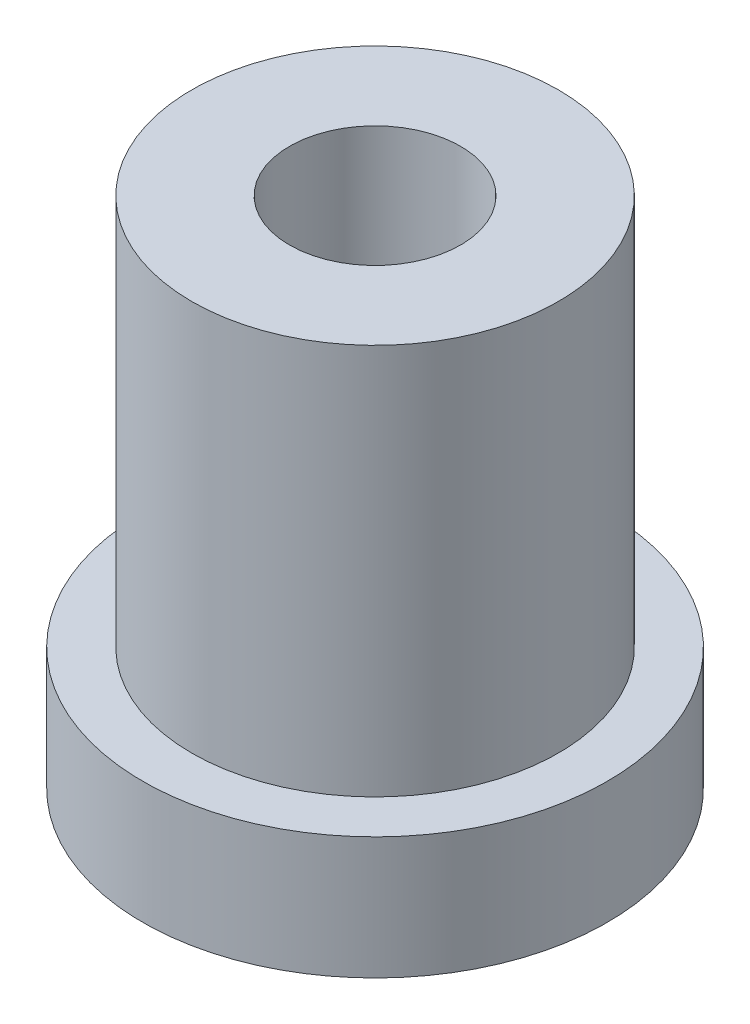
ISO-10303-21;
HEADER;
FILE_DESCRIPTION(('STEP AP214'),'2;1');
FILE_NAME('part.step','',(''),(''),'','','');
FILE_SCHEMA(('AUTOMOTIVE_DESIGN { 1 0 10303 214 1 1 1 1 }'));
ENDSEC;
DATA;
#1=APPLICATION_CONTEXT('core data for automotive mechanical design processes');
#2=APPLICATION_PROTOCOL_DEFINITION('international standard','automotive_design',2000,#1);
#3=PRODUCT_CONTEXT('',#1,'mechanical');
#4=PRODUCT('Part','Part','',(#3));
#5=PRODUCT_RELATED_PRODUCT_CATEGORY('part','',(#4));
#6=PRODUCT_DEFINITION_FORMATION('','',#4);
#7=PRODUCT_DEFINITION_CONTEXT('part definition',#1,'design');
#8=PRODUCT_DEFINITION('design','',#6,#7);
#9=PRODUCT_DEFINITION_SHAPE('','',#8);
#10=(LENGTH_UNIT() NAMED_UNIT(*) SI_UNIT(.MILLI.,.METRE.));
#11=(NAMED_UNIT(*) PLANE_ANGLE_UNIT() SI_UNIT($,.RADIAN.));
#12=(NAMED_UNIT(*) SI_UNIT($,.STERADIAN.) SOLID_ANGLE_UNIT());
#13=UNCERTAINTY_MEASURE_WITH_UNIT(LENGTH_MEASURE(1.E-05),#10,'distance_accuracy_value','');
#14=(GEOMETRIC_REPRESENTATION_CONTEXT(3) GLOBAL_UNCERTAINTY_ASSIGNED_CONTEXT((#13)) GLOBAL_UNIT_ASSIGNED_CONTEXT((#10,
#11,#12)) REPRESENTATION_CONTEXT('',''));
#15=CARTESIAN_POINT('',(0.,0.,0.));
#16=DIRECTION('',(0.,0.,1.));
#17=DIRECTION('',(1.,0.,0.));
#18=AXIS2_PLACEMENT_3D('',#15,#16,#17);
#19=CARTESIAN_POINT('',(0.,10.5,0.));
#20=DIRECTION('',(0.,-1.,0.));
#21=DIRECTION('',(0.,0.,-1.));
#22=AXIS2_PLACEMENT_3D('',#19,#20,#21);
#23=CYLINDRICAL_SURFACE('',#22,3.75);
#24=CARTESIAN_POINT('',(0.,10.5,0.));
#25=DIRECTION('',(0.,1.,0.));
#26=DIRECTION('',(0.,0.,1.));
#27=AXIS2_PLACEMENT_3D('',#24,#25,#26);
#28=CIRCLE('',#27,3.75);
#29=CARTESIAN_POINT('',(0.,10.5,3.75));
#30=VERTEX_POINT('',#29);
#31=EDGE_CURVE('E50',#30,#30,#28,.T.);
#32=ORIENTED_EDGE('',*,*,#31,.F.);
#33=EDGE_LOOP('',(#32));
#34=FACE_BOUND('',#33,.T.);
#35=CARTESIAN_POINT('',(0.,2.5,0.));
#36=DIRECTION('',(0.,-1.,0.));
#37=DIRECTION('',(0.,0.,-1.));
#38=AXIS2_PLACEMENT_3D('',#35,#36,#37);
#39=CIRCLE('',#38,3.75);
#40=CARTESIAN_POINT('',(0.,2.5,-3.75));
#41=VERTEX_POINT('',#40);
#42=EDGE_CURVE('E10',#41,#41,#39,.T.);
#43=ORIENTED_EDGE('',*,*,#42,.F.);
#44=EDGE_LOOP('',(#43));
#45=FACE_BOUND('',#44,.T.);
#46=ADVANCED_FACE('F43',(#34,#45),#23,.T.);
#47=CARTESIAN_POINT('',(0.,10.5,0.));
#48=DIRECTION('',(0.,1.,0.));
#49=DIRECTION('',(0.,0.,1.));
#50=AXIS2_PLACEMENT_3D('',#47,#48,#49);
#51=PLANE('',#50);
#52=CARTESIAN_POINT('',(0.,10.5,0.));
#53=DIRECTION('',(0.,1.,0.));
#54=DIRECTION('',(0.,0.,1.));
#55=AXIS2_PLACEMENT_3D('',#52,#53,#54);
#56=CIRCLE('',#55,1.75);
#57=CARTESIAN_POINT('',(0.,10.5,1.75));
#58=VERTEX_POINT('',#57);
#59=EDGE_CURVE('E60',#58,#58,#56,.T.);
#60=ORIENTED_EDGE('',*,*,#59,.F.);
#61=EDGE_LOOP('',(#60));
#62=FACE_BOUND('',#61,.T.);
#63=ORIENTED_EDGE('',*,*,#31,.T.);
#64=EDGE_LOOP('',(#63));
#65=FACE_BOUND('',#64,.T.);
#66=ADVANCED_FACE('F87',(#62,#65),#51,.T.);
#67=CARTESIAN_POINT('',(0.,0.,0.));
#68=DIRECTION('',(0.,1.,0.));
#69=DIRECTION('',(0.,0.,1.));
#70=AXIS2_PLACEMENT_3D('',#67,#68,#69);
#71=PLANE('',#70);
#72=CARTESIAN_POINT('',(0.,0.,0.));
#73=DIRECTION('',(0.,1.,0.));
#74=DIRECTION('',(0.,0.,1.));
#75=AXIS2_PLACEMENT_3D('',#72,#73,#74);
#76=CIRCLE('',#75,1.75);
#77=CARTESIAN_POINT('',(0.,0.,1.75));
#78=VERTEX_POINT('',#77);
#79=EDGE_CURVE('E55',#78,#78,#76,.T.);
#80=ORIENTED_EDGE('',*,*,#79,.T.);
#81=EDGE_LOOP('',(#80));
#82=FACE_BOUND('',#81,.T.);
#83=CARTESIAN_POINT('',(0.,0.,0.));
#84=DIRECTION('',(0.,-1.,0.));
#85=DIRECTION('',(0.,0.,-1.));
#86=AXIS2_PLACEMENT_3D('',#83,#84,#85);
#87=CIRCLE('',#86,4.75);
#88=CARTESIAN_POINT('',(0.,0.,-4.75));
#89=VERTEX_POINT('',#88);
#90=EDGE_CURVE('E67',#89,#89,#87,.T.);
#91=ORIENTED_EDGE('',*,*,#90,.T.);
#92=EDGE_LOOP('',(#91));
#93=FACE_BOUND('',#92,.T.);
#94=ADVANCED_FACE('F94',(#82,#93),#71,.F.);
#95=CARTESIAN_POINT('',(0.,10.5,0.));
#96=DIRECTION('',(0.,1.,0.));
#97=DIRECTION('',(0.,0.,1.));
#98=AXIS2_PLACEMENT_3D('',#95,#96,#97);
#99=CYLINDRICAL_SURFACE('',#98,1.75);
#100=ORIENTED_EDGE('',*,*,#79,.F.);
#101=EDGE_LOOP('',(#100));
#102=FACE_BOUND('',#101,.T.);
#103=ORIENTED_EDGE('',*,*,#59,.T.);
#104=EDGE_LOOP('',(#103));
#105=FACE_BOUND('',#104,.T.);
#106=ADVANCED_FACE('F84',(#102,#105),#99,.F.);
#107=CARTESIAN_POINT('',(0.,2.5,0.));
#108=DIRECTION('',(0.,-1.,0.));
#109=DIRECTION('',(0.,0.,-1.));
#110=AXIS2_PLACEMENT_3D('',#107,#108,#109);
#111=CYLINDRICAL_SURFACE('',#110,4.75);
#112=CARTESIAN_POINT('',(0.,2.5,0.));
#113=DIRECTION('',(0.,-1.,0.));
#114=DIRECTION('',(0.,0.,-1.));
#115=AXIS2_PLACEMENT_3D('',#112,#113,#114);
#116=CIRCLE('',#115,4.75);
#117=CARTESIAN_POINT('',(0.,2.5,-4.75));
#118=VERTEX_POINT('',#117);
#119=EDGE_CURVE('E66',#118,#118,#116,.T.);
#120=ORIENTED_EDGE('',*,*,#119,.T.);
#121=EDGE_LOOP('',(#120));
#122=FACE_BOUND('',#121,.T.);
#123=ORIENTED_EDGE('',*,*,#90,.F.);
#124=EDGE_LOOP('',(#123));
#125=FACE_BOUND('',#124,.T.);
#126=ADVANCED_FACE('F75',(#122,#125),#111,.T.);
#127=CARTESIAN_POINT('',(0.,2.5,0.));
#128=DIRECTION('',(0.,-1.,0.));
#129=DIRECTION('',(0.,0.,-1.));
#130=AXIS2_PLACEMENT_3D('',#127,#128,#129);
#131=PLANE('',#130);
#132=ORIENTED_EDGE('',*,*,#42,.T.);
#133=EDGE_LOOP('',(#132));
#134=FACE_BOUND('',#133,.T.);
#135=ORIENTED_EDGE('',*,*,#119,.F.);
#136=EDGE_LOOP('',(#135));
#137=FACE_BOUND('',#136,.T.);
#138=ADVANCED_FACE('F78',(#134,#137),#131,.F.);
#139=CLOSED_SHELL('',(#46,#66,#94,#106,#126,#138));
#140=MANIFOLD_SOLID_BREP('B2',#139);
#141=ADVANCED_BREP_SHAPE_REPRESENTATION('',(#18,#140),#14);
#142=SHAPE_DEFINITION_REPRESENTATION(#9,#141);
ENDSEC;
END-ISO-10303-21;
